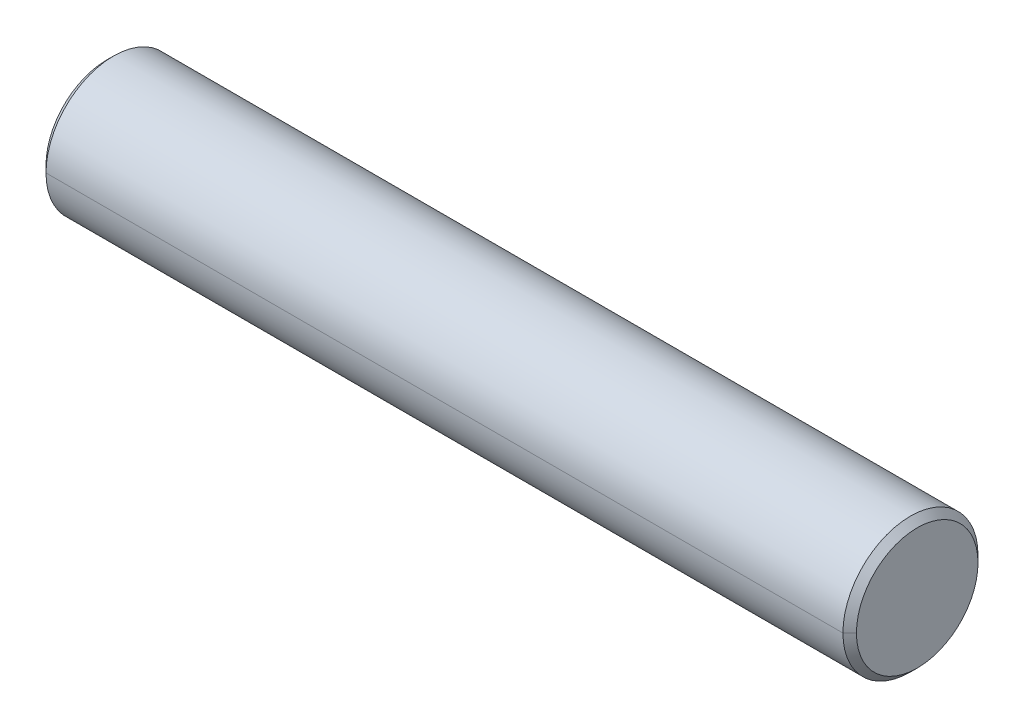
ISO-10303-21;
HEADER;
FILE_DESCRIPTION(('STEP AP214'),'2;1');
FILE_NAME('part.step','',(''),(''),'','','');
FILE_SCHEMA(('AUTOMOTIVE_DESIGN { 1 0 10303 214 1 1 1 1 }'));
ENDSEC;
DATA;
#1=APPLICATION_CONTEXT('core data for automotive mechanical design processes');
#2=APPLICATION_PROTOCOL_DEFINITION('international standard','automotive_design',2000,#1);
#3=PRODUCT_CONTEXT('',#1,'mechanical');
#4=PRODUCT('Part','Part','',(#3));
#5=PRODUCT_RELATED_PRODUCT_CATEGORY('part','',(#4));
#6=PRODUCT_DEFINITION_FORMATION('','',#4);
#7=PRODUCT_DEFINITION_CONTEXT('part definition',#1,'design');
#8=PRODUCT_DEFINITION('design','',#6,#7);
#9=PRODUCT_DEFINITION_SHAPE('','',#8);
#10=(LENGTH_UNIT() NAMED_UNIT(*) SI_UNIT(.MILLI.,.METRE.));
#11=(NAMED_UNIT(*) PLANE_ANGLE_UNIT() SI_UNIT($,.RADIAN.));
#12=(NAMED_UNIT(*) SI_UNIT($,.STERADIAN.) SOLID_ANGLE_UNIT());
#13=UNCERTAINTY_MEASURE_WITH_UNIT(LENGTH_MEASURE(1.E-05),#10,'distance_accuracy_value','');
#14=(GEOMETRIC_REPRESENTATION_CONTEXT(3) GLOBAL_UNCERTAINTY_ASSIGNED_CONTEXT((#13)) GLOBAL_UNIT_ASSIGNED_CONTEXT((#10,
#11,#12)) REPRESENTATION_CONTEXT('',''));
#15=CARTESIAN_POINT('',(0.,0.,0.));
#16=DIRECTION('',(0.,0.,1.));
#17=DIRECTION('',(1.,0.,0.));
#18=AXIS2_PLACEMENT_3D('',#15,#16,#17);
#19=CARTESIAN_POINT('',(80.,0.,0.));
#20=DIRECTION('',(1.,0.,0.));
#21=DIRECTION('',(0.,1.,0.));
#22=AXIS2_PLACEMENT_3D('',#19,#20,#21);
#23=CYLINDRICAL_SURFACE('',#22,7.5);
#24=DIRECTION('',(1.,0.,0.));
#25=VECTOR('',#24,1.);
#26=CARTESIAN_POINT('',(0.75,0.,7.5));
#27=LINE('',#26,#25);
#28=CARTESIAN_POINT('',(0.75,0.,7.5));
#29=VERTEX_POINT('',#28);
#30=CARTESIAN_POINT('',(89.25,0.,7.5));
#31=VERTEX_POINT('',#30);
#32=EDGE_CURVE('E11',#29,#31,#27,.T.);
#33=ORIENTED_EDGE('',*,*,#32,.F.);
#34=CARTESIAN_POINT('',(0.75,0.,0.));
#35=DIRECTION('',(1.,0.,0.));
#36=DIRECTION('',(0.,0.,-1.));
#37=AXIS2_PLACEMENT_3D('',#34,#35,#36);
#38=CIRCLE('',#37,7.5);
#39=CARTESIAN_POINT('',(0.75,0.,-7.5));
#40=VERTEX_POINT('',#39);
#41=EDGE_CURVE('E25',#29,#40,#38,.T.);
#42=ORIENTED_EDGE('',*,*,#41,.T.);
#43=DIRECTION('',(1.,0.,0.));
#44=VECTOR('',#43,1.);
#45=CARTESIAN_POINT('',(0.75,0.,-7.5));
#46=LINE('',#45,#44);
#47=CARTESIAN_POINT('',(89.25,0.,-7.5));
#48=VERTEX_POINT('',#47);
#49=EDGE_CURVE('E108',#40,#48,#46,.T.);
#50=ORIENTED_EDGE('',*,*,#49,.T.);
#51=CARTESIAN_POINT('',(89.25,0.,0.));
#52=DIRECTION('',(1.,0.,0.));
#53=DIRECTION('',(0.,0.,-1.));
#54=AXIS2_PLACEMENT_3D('',#51,#52,#53);
#55=CIRCLE('',#54,7.5);
#56=EDGE_CURVE('E103',#31,#48,#55,.T.);
#57=ORIENTED_EDGE('',*,*,#56,.F.);
#58=EDGE_LOOP('',(#33,#42,#50,#57));
#59=FACE_BOUND('',#58,.T.);
#60=ADVANCED_FACE('F17',(#59),#23,.T.);
#61=CARTESIAN_POINT('',(89.25,0.,0.));
#62=DIRECTION('',(-1.,0.,0.));
#63=DIRECTION('',(0.,1.,0.));
#64=AXIS2_PLACEMENT_3D('',#61,#62,#63);
#65=CONICAL_SURFACE('',#64,7.5,0.785398163397448);
#66=DIRECTION('',(-0.707106781186548,0.,-0.707106781186547));
#67=VECTOR('',#66,1.);
#68=CARTESIAN_POINT('',(90.,0.,-6.75));
#69=LINE('',#68,#67);
#70=CARTESIAN_POINT('',(90.,0.,-6.75));
#71=VERTEX_POINT('',#70);
#72=EDGE_CURVE('E98',#71,#48,#69,.T.);
#73=ORIENTED_EDGE('',*,*,#72,.F.);
#74=CARTESIAN_POINT('',(90.,0.,0.));
#75=DIRECTION('',(1.,0.,0.));
#76=DIRECTION('',(0.,0.,-1.));
#77=AXIS2_PLACEMENT_3D('',#74,#75,#76);
#78=CIRCLE('',#77,6.75);
#79=CARTESIAN_POINT('',(90.,0.,6.75));
#80=VERTEX_POINT('',#79);
#81=EDGE_CURVE('E93',#80,#71,#78,.T.);
#82=ORIENTED_EDGE('',*,*,#81,.F.);
#83=DIRECTION('',(-0.707106781186549,0.,0.707106781186546));
#84=VECTOR('',#83,1.);
#85=CARTESIAN_POINT('',(90.,0.,6.75));
#86=LINE('',#85,#84);
#87=EDGE_CURVE('E88',#80,#31,#86,.T.);
#88=ORIENTED_EDGE('',*,*,#87,.T.);
#89=ORIENTED_EDGE('',*,*,#56,.T.);
#90=EDGE_LOOP('',(#73,#82,#88,#89));
#91=FACE_BOUND('',#90,.T.);
#92=ADVANCED_FACE('F125',(#91),#65,.T.);
#93=CARTESIAN_POINT('',(89.25,0.,0.));
#94=DIRECTION('',(-1.,0.,0.));
#95=DIRECTION('',(0.,-1.,0.));
#96=AXIS2_PLACEMENT_3D('',#93,#94,#95);
#97=CONICAL_SURFACE('',#96,7.5,0.785398163397448);
#98=ORIENTED_EDGE('',*,*,#72,.T.);
#99=CARTESIAN_POINT('',(89.25,0.,0.));
#100=DIRECTION('',(1.,0.,0.));
#101=DIRECTION('',(0.,0.,-1.));
#102=AXIS2_PLACEMENT_3D('',#99,#100,#101);
#103=CIRCLE('',#102,7.5);
#104=EDGE_CURVE('E83',#48,#31,#103,.T.);
#105=ORIENTED_EDGE('',*,*,#104,.T.);
#106=ORIENTED_EDGE('',*,*,#87,.F.);
#107=CARTESIAN_POINT('',(90.,0.,0.));
#108=DIRECTION('',(1.,0.,0.));
#109=DIRECTION('',(0.,0.,-1.));
#110=AXIS2_PLACEMENT_3D('',#107,#108,#109);
#111=CIRCLE('',#110,6.75);
#112=EDGE_CURVE('E71',#71,#80,#111,.T.);
#113=ORIENTED_EDGE('',*,*,#112,.F.);
#114=EDGE_LOOP('',(#98,#105,#106,#113));
#115=FACE_BOUND('',#114,.T.);
#116=ADVANCED_FACE('F123',(#115),#97,.T.);
#117=CARTESIAN_POINT('',(90.,0.,-6.75));
#118=DIRECTION('',(-1.,0.,0.));
#119=DIRECTION('',(0.,0.,1.));
#120=AXIS2_PLACEMENT_3D('',#117,#118,#119);
#121=PLANE('',#120);
#122=ORIENTED_EDGE('',*,*,#112,.T.);
#123=ORIENTED_EDGE('',*,*,#81,.T.);
#124=EDGE_LOOP('',(#122,#123));
#125=FACE_BOUND('',#124,.T.);
#126=ADVANCED_FACE('F127',(#125),#121,.F.);
#127=CARTESIAN_POINT('',(80.,0.,0.));
#128=DIRECTION('',(1.,0.,0.));
#129=DIRECTION('',(0.,-1.,-2.45264421585441E-11));
#130=AXIS2_PLACEMENT_3D('',#127,#128,#129);
#131=CYLINDRICAL_SURFACE('',#130,7.5);
#132=ORIENTED_EDGE('',*,*,#32,.T.);
#133=ORIENTED_EDGE('',*,*,#104,.F.);
#134=ORIENTED_EDGE('',*,*,#49,.F.);
#135=CARTESIAN_POINT('',(0.75,0.,0.));
#136=DIRECTION('',(1.,0.,0.));
#137=DIRECTION('',(0.,0.,-1.));
#138=AXIS2_PLACEMENT_3D('',#135,#136,#137);
#139=CIRCLE('',#138,7.5);
#140=EDGE_CURVE('E69',#40,#29,#139,.T.);
#141=ORIENTED_EDGE('',*,*,#140,.T.);
#142=EDGE_LOOP('',(#132,#133,#134,#141));
#143=FACE_BOUND('',#142,.T.);
#144=ADVANCED_FACE('F119',(#143),#131,.T.);
#145=CARTESIAN_POINT('',(0.,0.,0.));
#146=DIRECTION('',(1.,0.,0.));
#147=DIRECTION('',(0.,-1.,0.));
#148=AXIS2_PLACEMENT_3D('',#145,#146,#147);
#149=CONICAL_SURFACE('',#148,6.75,0.785398163397448);
#150=DIRECTION('',(0.707106781186548,0.,0.707106781186547));
#151=VECTOR('',#150,1.);
#152=CARTESIAN_POINT('',(0.,0.,6.75));
#153=LINE('',#152,#151);
#154=CARTESIAN_POINT('',(0.,0.,6.75));
#155=VERTEX_POINT('',#154);
#156=EDGE_CURVE('E59',#155,#29,#153,.T.);
#157=ORIENTED_EDGE('',*,*,#156,.T.);
#158=ORIENTED_EDGE('',*,*,#140,.F.);
#159=DIRECTION('',(0.707106781186548,0.,-0.707106781186547));
#160=VECTOR('',#159,1.);
#161=CARTESIAN_POINT('',(0.,0.,-6.75));
#162=LINE('',#161,#160);
#163=CARTESIAN_POINT('',(0.,0.,-6.75));
#164=VERTEX_POINT('',#163);
#165=EDGE_CURVE('E60',#164,#40,#162,.T.);
#166=ORIENTED_EDGE('',*,*,#165,.F.);
#167=CARTESIAN_POINT('',(0.,0.,0.));
#168=DIRECTION('',(1.,0.,0.));
#169=DIRECTION('',(0.,0.,-1.));
#170=AXIS2_PLACEMENT_3D('',#167,#168,#169);
#171=CIRCLE('',#170,6.75);
#172=EDGE_CURVE('E54',#164,#155,#171,.T.);
#173=ORIENTED_EDGE('',*,*,#172,.T.);
#174=EDGE_LOOP('',(#157,#158,#166,#173));
#175=FACE_BOUND('',#174,.T.);
#176=ADVANCED_FACE('F56',(#175),#149,.T.);
#177=CARTESIAN_POINT('',(0.,0.,0.));
#178=DIRECTION('',(1.,0.,0.));
#179=DIRECTION('',(0.,0.,-1.));
#180=AXIS2_PLACEMENT_3D('',#177,#178,#179);
#181=PLANE('',#180);
#182=CARTESIAN_POINT('',(0.,0.,0.));
#183=DIRECTION('',(1.,0.,0.));
#184=DIRECTION('',(0.,0.,-1.));
#185=AXIS2_PLACEMENT_3D('',#182,#183,#184);
#186=CIRCLE('',#185,6.75);
#187=EDGE_CURVE('E63',#155,#164,#186,.T.);
#188=ORIENTED_EDGE('',*,*,#187,.F.);
#189=ORIENTED_EDGE('',*,*,#172,.F.);
#190=EDGE_LOOP('',(#188,#189));
#191=FACE_BOUND('',#190,.T.);
#192=ADVANCED_FACE('F65',(#191),#181,.F.);
#193=CARTESIAN_POINT('',(0.,0.,0.));
#194=DIRECTION('',(1.,0.,0.));
#195=DIRECTION('',(0.,1.,0.));
#196=AXIS2_PLACEMENT_3D('',#193,#194,#195);
#197=CONICAL_SURFACE('',#196,6.75,0.785398163397448);
#198=ORIENTED_EDGE('',*,*,#156,.F.);
#199=ORIENTED_EDGE('',*,*,#187,.T.);
#200=ORIENTED_EDGE('',*,*,#165,.T.);
#201=ORIENTED_EDGE('',*,*,#41,.F.);
#202=EDGE_LOOP('',(#198,#199,#200,#201));
#203=FACE_BOUND('',#202,.T.);
#204=ADVANCED_FACE('F68',(#203),#197,.T.);
#205=CLOSED_SHELL('',(#60,#92,#116,#126,#144,#176,#192,#204));
#206=MANIFOLD_SOLID_BREP('B1',#205);
#207=ADVANCED_BREP_SHAPE_REPRESENTATION('',(#18,#206),#14);
#208=SHAPE_DEFINITION_REPRESENTATION(#9,#207);
ENDSEC;
END-ISO-10303-21;
